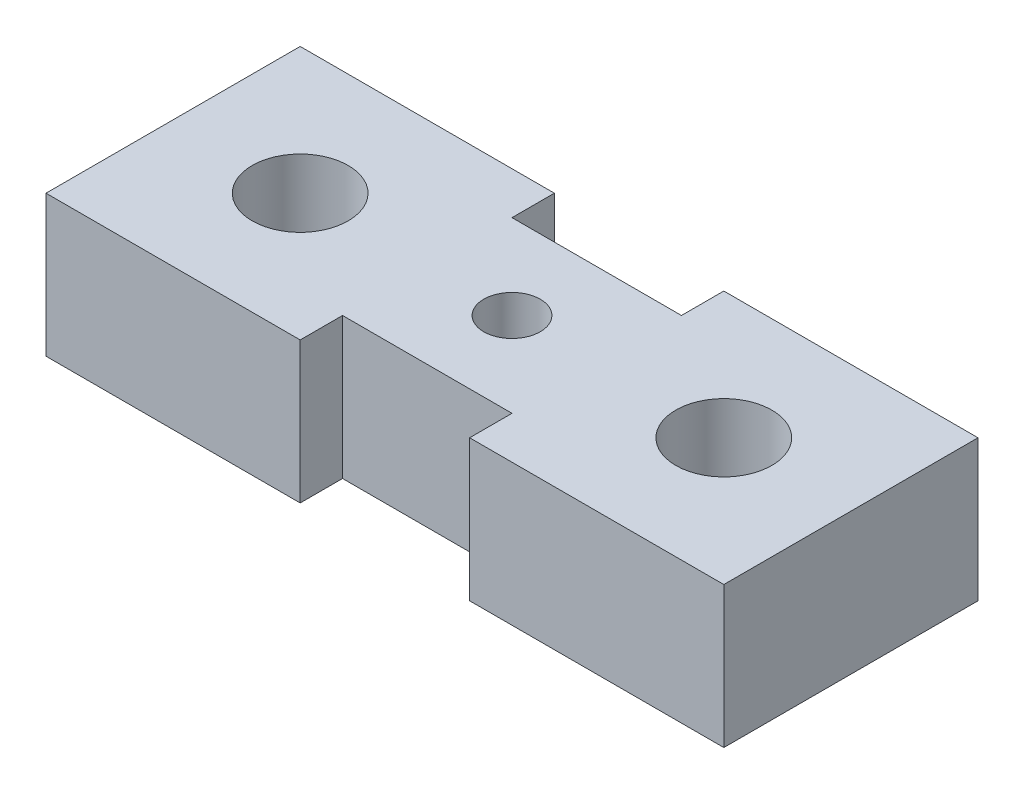
ISO-10303-21;
HEADER;
FILE_DESCRIPTION(('STEP AP214'),'2;1');
FILE_NAME('part.step','',(''),(''),'','','');
FILE_SCHEMA(('AUTOMOTIVE_DESIGN { 1 0 10303 214 1 1 1 1 }'));
ENDSEC;
DATA;
#1=APPLICATION_CONTEXT('core data for automotive mechanical design processes');
#2=APPLICATION_PROTOCOL_DEFINITION('international standard','automotive_design',2000,#1);
#3=PRODUCT_CONTEXT('',#1,'mechanical');
#4=PRODUCT('Part','Part','',(#3));
#5=PRODUCT_RELATED_PRODUCT_CATEGORY('part','',(#4));
#6=PRODUCT_DEFINITION_FORMATION('','',#4);
#7=PRODUCT_DEFINITION_CONTEXT('part definition',#1,'design');
#8=PRODUCT_DEFINITION('design','',#6,#7);
#9=PRODUCT_DEFINITION_SHAPE('','',#8);
#10=(LENGTH_UNIT() NAMED_UNIT(*) SI_UNIT(.MILLI.,.METRE.));
#11=(NAMED_UNIT(*) PLANE_ANGLE_UNIT() SI_UNIT($,.RADIAN.));
#12=(NAMED_UNIT(*) SI_UNIT($,.STERADIAN.) SOLID_ANGLE_UNIT());
#13=UNCERTAINTY_MEASURE_WITH_UNIT(LENGTH_MEASURE(1.E-05),#10,'distance_accuracy_value','');
#14=(GEOMETRIC_REPRESENTATION_CONTEXT(3) GLOBAL_UNCERTAINTY_ASSIGNED_CONTEXT((#13)) GLOBAL_UNIT_ASSIGNED_CONTEXT((#10,
#11,#12)) REPRESENTATION_CONTEXT('',''));
#15=CARTESIAN_POINT('',(0.,0.,0.));
#16=DIRECTION('',(0.,0.,1.));
#17=DIRECTION('',(1.,0.,0.));
#18=AXIS2_PLACEMENT_3D('',#15,#16,#17);
#19=CARTESIAN_POINT('',(-114.694405771183,5.,29.4556087548719));
#20=DIRECTION('',(0.,0.,-1.));
#21=DIRECTION('',(-1.,0.,0.));
#22=AXIS2_PLACEMENT_3D('',#19,#20,#21);
#23=PLANE('',#22);
#24=DIRECTION('',(1.,0.,0.));
#25=VECTOR('',#24,1.);
#26=CARTESIAN_POINT('',(-114.694405771183,5.,29.4556087548719));
#27=LINE('',#26,#25);
#28=CARTESIAN_POINT('',(-99.6944057711826,5.,29.4556087548719));
#29=VERTEX_POINT('',#28);
#30=CARTESIAN_POINT('',(-90.6944057711826,5.,29.4556087548719));
#31=VERTEX_POINT('',#30);
#32=EDGE_CURVE('E233',#29,#31,#27,.T.);
#33=ORIENTED_EDGE('',*,*,#32,.F.);
#34=DIRECTION('',(0.,1.,0.));
#35=VECTOR('',#34,1.);
#36=CARTESIAN_POINT('',(-99.6944057711826,0.,29.4556087548719));
#37=LINE('',#36,#35);
#38=CARTESIAN_POINT('',(-99.6944057711826,0.,29.4556087548719));
#39=VERTEX_POINT('',#38);
#40=EDGE_CURVE('E171',#39,#29,#37,.T.);
#41=ORIENTED_EDGE('',*,*,#40,.F.);
#42=DIRECTION('',(1.,0.,0.));
#43=VECTOR('',#42,1.);
#44=CARTESIAN_POINT('',(-114.694405771183,0.,29.4556087548719));
#45=LINE('',#44,#43);
#46=CARTESIAN_POINT('',(-90.6944057711826,0.,29.4556087548719));
#47=VERTEX_POINT('',#46);
#48=EDGE_CURVE('E153',#39,#47,#45,.T.);
#49=ORIENTED_EDGE('',*,*,#48,.T.);
#50=DIRECTION('',(0.,-1.,0.));
#51=VECTOR('',#50,1.);
#52=CARTESIAN_POINT('',(-90.6944057711826,5.,29.4556087548719));
#53=LINE('',#52,#51);
#54=EDGE_CURVE('E48',#31,#47,#53,.T.);
#55=ORIENTED_EDGE('',*,*,#54,.F.);
#56=EDGE_LOOP('',(#33,#41,#49,#55));
#57=FACE_BOUND('',#56,.T.);
#58=ADVANCED_FACE('F39',(#57),#23,.F.);
#59=CARTESIAN_POINT('',(-114.694405771183,5.,20.4556087548719));
#60=DIRECTION('',(0.,0.,1.));
#61=DIRECTION('',(1.,0.,0.));
#62=AXIS2_PLACEMENT_3D('',#59,#60,#61);
#63=PLANE('',#62);
#64=DIRECTION('',(-1.,0.,0.));
#65=VECTOR('',#64,1.);
#66=CARTESIAN_POINT('',(-114.694405771183,5.,20.4556087548719));
#67=LINE('',#66,#65);
#68=CARTESIAN_POINT('',(-105.694405771183,5.,20.4556087548719));
#69=VERTEX_POINT('',#68);
#70=CARTESIAN_POINT('',(-114.694405771183,5.,20.4556087548719));
#71=VERTEX_POINT('',#70);
#72=EDGE_CURVE('E242',#69,#71,#67,.T.);
#73=ORIENTED_EDGE('',*,*,#72,.F.);
#74=DIRECTION('',(0.,1.,0.));
#75=VECTOR('',#74,1.);
#76=CARTESIAN_POINT('',(-105.694405771183,0.,20.4556087548719));
#77=LINE('',#76,#75);
#78=CARTESIAN_POINT('',(-105.694405771183,0.,20.4556087548719));
#79=VERTEX_POINT('',#78);
#80=EDGE_CURVE('E168',#79,#69,#77,.T.);
#81=ORIENTED_EDGE('',*,*,#80,.F.);
#82=DIRECTION('',(-1.,0.,0.));
#83=VECTOR('',#82,1.);
#84=CARTESIAN_POINT('',(-114.694405771183,0.,20.4556087548719));
#85=LINE('',#84,#83);
#86=CARTESIAN_POINT('',(-114.694405771183,0.,20.4556087548719));
#87=VERTEX_POINT('',#86);
#88=EDGE_CURVE('E260',#79,#87,#85,.T.);
#89=ORIENTED_EDGE('',*,*,#88,.T.);
#90=DIRECTION('',(0.,-1.,0.));
#91=VECTOR('',#90,1.);
#92=CARTESIAN_POINT('',(-114.694405771183,5.,20.4556087548719));
#93=LINE('',#92,#91);
#94=EDGE_CURVE('E247',#71,#87,#93,.T.);
#95=ORIENTED_EDGE('',*,*,#94,.F.);
#96=EDGE_LOOP('',(#73,#81,#89,#95));
#97=FACE_BOUND('',#96,.T.);
#98=ADVANCED_FACE('F310',(#97),#63,.F.);
#99=CARTESIAN_POINT('',(-114.694405771183,5.,20.4556087548719));
#100=DIRECTION('',(1.,0.,0.));
#101=DIRECTION('',(0.,0.,-1.));
#102=AXIS2_PLACEMENT_3D('',#99,#100,#101);
#103=PLANE('',#102);
#104=DIRECTION('',(0.,0.,1.));
#105=VECTOR('',#104,1.);
#106=CARTESIAN_POINT('',(-114.694405771183,0.,20.4556087548719));
#107=LINE('',#106,#105);
#108=CARTESIAN_POINT('',(-114.694405771183,0.,29.4556087548719));
#109=VERTEX_POINT('',#108);
#110=EDGE_CURVE('E248',#87,#109,#107,.T.);
#111=ORIENTED_EDGE('',*,*,#110,.T.);
#112=DIRECTION('',(0.,-1.,0.));
#113=VECTOR('',#112,1.);
#114=CARTESIAN_POINT('',(-114.694405771183,5.,29.4556087548719));
#115=LINE('',#114,#113);
#116=CARTESIAN_POINT('',(-114.694405771183,5.,29.4556087548719));
#117=VERTEX_POINT('',#116);
#118=EDGE_CURVE('E11',#117,#109,#115,.T.);
#119=ORIENTED_EDGE('',*,*,#118,.F.);
#120=DIRECTION('',(0.,0.,1.));
#121=VECTOR('',#120,1.);
#122=CARTESIAN_POINT('',(-114.694405771183,5.,20.4556087548719));
#123=LINE('',#122,#121);
#124=EDGE_CURVE('E229',#71,#117,#123,.T.);
#125=ORIENTED_EDGE('',*,*,#124,.F.);
#126=ORIENTED_EDGE('',*,*,#94,.T.);
#127=EDGE_LOOP('',(#111,#119,#125,#126));
#128=FACE_BOUND('',#127,.T.);
#129=ADVANCED_FACE('F41',(#128),#103,.F.);
#130=CARTESIAN_POINT('',(-105.694405771183,0.,29.4556087548719));
#131=VERTEX_POINT('',#130);
#132=EDGE_CURVE('E253',#109,#131,#45,.T.);
#133=ORIENTED_EDGE('',*,*,#132,.T.);
#134=DIRECTION('',(0.,1.,0.));
#135=VECTOR('',#134,1.);
#136=CARTESIAN_POINT('',(-105.694405771183,0.,29.4556087548719));
#137=LINE('',#136,#135);
#138=CARTESIAN_POINT('',(-105.694405771183,5.,29.4556087548719));
#139=VERTEX_POINT('',#138);
#140=EDGE_CURVE('E175',#131,#139,#137,.T.);
#141=ORIENTED_EDGE('',*,*,#140,.T.);
#142=EDGE_CURVE('E235',#117,#139,#27,.T.);
#143=ORIENTED_EDGE('',*,*,#142,.F.);
#144=ORIENTED_EDGE('',*,*,#118,.T.);
#145=EDGE_LOOP('',(#133,#141,#143,#144));
#146=FACE_BOUND('',#145,.T.);
#147=ADVANCED_FACE('F313',(#146),#23,.F.);
#148=CARTESIAN_POINT('',(-90.6944057711826,5.,20.4556087548719));
#149=DIRECTION('',(-1.,0.,0.));
#150=DIRECTION('',(0.,0.,1.));
#151=AXIS2_PLACEMENT_3D('',#148,#149,#150);
#152=PLANE('',#151);
#153=DIRECTION('',(0.,0.,-1.));
#154=VECTOR('',#153,1.);
#155=CARTESIAN_POINT('',(-90.6944057711826,0.,20.4556087548719));
#156=LINE('',#155,#154);
#157=CARTESIAN_POINT('',(-90.6944057711826,0.,20.4556087548719));
#158=VERTEX_POINT('',#157);
#159=EDGE_CURVE('E257',#47,#158,#156,.T.);
#160=ORIENTED_EDGE('',*,*,#159,.T.);
#161=DIRECTION('',(0.,-1.,0.));
#162=VECTOR('',#161,1.);
#163=CARTESIAN_POINT('',(-90.6944057711826,5.,20.4556087548719));
#164=LINE('',#163,#162);
#165=CARTESIAN_POINT('',(-90.6944057711826,5.,20.4556087548719));
#166=VERTEX_POINT('',#165);
#167=EDGE_CURVE('E267',#166,#158,#164,.T.);
#168=ORIENTED_EDGE('',*,*,#167,.F.);
#169=DIRECTION('',(0.,0.,-1.));
#170=VECTOR('',#169,1.);
#171=CARTESIAN_POINT('',(-90.6944057711826,5.,20.4556087548719));
#172=LINE('',#171,#170);
#173=EDGE_CURVE('E239',#31,#166,#172,.T.);
#174=ORIENTED_EDGE('',*,*,#173,.F.);
#175=ORIENTED_EDGE('',*,*,#54,.T.);
#176=EDGE_LOOP('',(#160,#168,#174,#175));
#177=FACE_BOUND('',#176,.T.);
#178=ADVANCED_FACE('F275',(#177),#152,.F.);
#179=CARTESIAN_POINT('',(-99.6944057711826,0.,20.4556087548719));
#180=VERTEX_POINT('',#179);
#181=EDGE_CURVE('E234',#158,#180,#85,.T.);
#182=ORIENTED_EDGE('',*,*,#181,.T.);
#183=DIRECTION('',(0.,1.,0.));
#184=VECTOR('',#183,1.);
#185=CARTESIAN_POINT('',(-99.6944057711826,0.,20.4556087548719));
#186=LINE('',#185,#184);
#187=CARTESIAN_POINT('',(-99.6944057711826,5.,20.4556087548719));
#188=VERTEX_POINT('',#187);
#189=EDGE_CURVE('E205',#180,#188,#186,.T.);
#190=ORIENTED_EDGE('',*,*,#189,.T.);
#191=EDGE_CURVE('E243',#166,#188,#67,.T.);
#192=ORIENTED_EDGE('',*,*,#191,.F.);
#193=ORIENTED_EDGE('',*,*,#167,.T.);
#194=EDGE_LOOP('',(#182,#190,#192,#193));
#195=FACE_BOUND('',#194,.T.);
#196=ADVANCED_FACE('F281',(#195),#63,.F.);
#197=CARTESIAN_POINT('',(0.,5.,0.));
#198=DIRECTION('',(0.,1.,0.));
#199=DIRECTION('',(0.,0.,1.));
#200=AXIS2_PLACEMENT_3D('',#197,#198,#199);
#201=PLANE('',#200);
#202=CARTESIAN_POINT('',(-110.194405771183,5.,24.9556087548719));
#203=DIRECTION('',(0.,1.,0.));
#204=DIRECTION('',(0.,0.,1.));
#205=AXIS2_PLACEMENT_3D('',#202,#203,#204);
#206=CIRCLE('',#205,1.7);
#207=CARTESIAN_POINT('',(-110.194405771183,5.,26.6556087548719));
#208=VERTEX_POINT('',#207);
#209=EDGE_CURVE('E161',#208,#208,#206,.T.);
#210=ORIENTED_EDGE('',*,*,#209,.F.);
#211=EDGE_LOOP('',(#210));
#212=FACE_BOUND('',#211,.T.);
#213=DIRECTION('',(0.,0.,1.));
#214=VECTOR('',#213,1.);
#215=CARTESIAN_POINT('',(-105.694405771183,5.,20.4556087548719));
#216=LINE('',#215,#214);
#217=CARTESIAN_POINT('',(-105.694405771183,5.,21.9556087548719));
#218=VERTEX_POINT('',#217);
#219=EDGE_CURVE('E193',#69,#218,#216,.T.);
#220=ORIENTED_EDGE('',*,*,#219,.F.);
#221=ORIENTED_EDGE('',*,*,#72,.T.);
#222=ORIENTED_EDGE('',*,*,#124,.T.);
#223=ORIENTED_EDGE('',*,*,#142,.T.);
#224=DIRECTION('',(0.,0.,1.));
#225=VECTOR('',#224,1.);
#226=CARTESIAN_POINT('',(-105.694405771183,5.,29.4556087548719));
#227=LINE('',#226,#225);
#228=CARTESIAN_POINT('',(-105.694405771183,5.,27.9556087548719));
#229=VERTEX_POINT('',#228);
#230=EDGE_CURVE('E155',#229,#139,#227,.T.);
#231=ORIENTED_EDGE('',*,*,#230,.F.);
#232=DIRECTION('',(-1.,0.,0.));
#233=VECTOR('',#232,1.);
#234=CARTESIAN_POINT('',(-105.694405771183,5.,27.9556087548719));
#235=LINE('',#234,#233);
#236=CARTESIAN_POINT('',(-99.6944057711826,5.,27.9556087548719));
#237=VERTEX_POINT('',#236);
#238=EDGE_CURVE('E158',#237,#229,#235,.T.);
#239=ORIENTED_EDGE('',*,*,#238,.F.);
#240=DIRECTION('',(0.,0.,-1.));
#241=VECTOR('',#240,1.);
#242=CARTESIAN_POINT('',(-99.6944057711826,5.,29.4556087548719));
#243=LINE('',#242,#241);
#244=EDGE_CURVE('E135',#29,#237,#243,.T.);
#245=ORIENTED_EDGE('',*,*,#244,.F.);
#246=ORIENTED_EDGE('',*,*,#32,.T.);
#247=ORIENTED_EDGE('',*,*,#173,.T.);
#248=ORIENTED_EDGE('',*,*,#191,.T.);
#249=DIRECTION('',(0.,0.,-1.));
#250=VECTOR('',#249,1.);
#251=CARTESIAN_POINT('',(-99.6944057711826,5.,20.4556087548719));
#252=LINE('',#251,#250);
#253=CARTESIAN_POINT('',(-99.6944057711826,5.,21.9556087548719));
#254=VERTEX_POINT('',#253);
#255=EDGE_CURVE('E186',#254,#188,#252,.T.);
#256=ORIENTED_EDGE('',*,*,#255,.F.);
#257=DIRECTION('',(1.,0.,0.));
#258=VECTOR('',#257,1.);
#259=CARTESIAN_POINT('',(-105.694405771183,5.,21.9556087548719));
#260=LINE('',#259,#258);
#261=EDGE_CURVE('E197',#218,#254,#260,.T.);
#262=ORIENTED_EDGE('',*,*,#261,.F.);
#263=EDGE_LOOP('',(#220,#221,#222,#223,#231,#239,#245,#246,#247,#248,#256,#262));
#264=FACE_BOUND('',#263,.T.);
#265=CARTESIAN_POINT('',(-102.694405771183,5.,24.9556087548719));
#266=DIRECTION('',(0.,1.,0.));
#267=DIRECTION('',(0.,0.,1.));
#268=AXIS2_PLACEMENT_3D('',#265,#266,#267);
#269=CIRCLE('',#268,0.999999999999998);
#270=CARTESIAN_POINT('',(-102.694405771183,5.,25.9556087548719));
#271=VERTEX_POINT('',#270);
#272=EDGE_CURVE('E174',#271,#271,#269,.T.);
#273=ORIENTED_EDGE('',*,*,#272,.F.);
#274=EDGE_LOOP('',(#273));
#275=FACE_BOUND('',#274,.T.);
#276=CARTESIAN_POINT('',(-95.1944057711826,5.,24.9556087548719));
#277=DIRECTION('',(0.,1.,0.));
#278=DIRECTION('',(0.,0.,1.));
#279=AXIS2_PLACEMENT_3D('',#276,#277,#278);
#280=CIRCLE('',#279,1.7);
#281=CARTESIAN_POINT('',(-95.1944057711826,5.,26.6556087548719));
#282=VERTEX_POINT('',#281);
#283=EDGE_CURVE('E218',#282,#282,#280,.T.);
#284=ORIENTED_EDGE('',*,*,#283,.F.);
#285=EDGE_LOOP('',(#284));
#286=FACE_BOUND('',#285,.T.);
#287=ADVANCED_FACE('F286',(#212,#264,#275,#286),#201,.T.);
#288=CARTESIAN_POINT('',(0.,0.,0.));
#289=DIRECTION('',(0.,1.,0.));
#290=DIRECTION('',(0.,0.,1.));
#291=AXIS2_PLACEMENT_3D('',#288,#289,#290);
#292=PLANE('',#291);
#293=CARTESIAN_POINT('',(-110.194405771183,0.,24.9556087548719));
#294=DIRECTION('',(0.,1.,0.));
#295=DIRECTION('',(0.,0.,1.));
#296=AXIS2_PLACEMENT_3D('',#293,#294,#295);
#297=CIRCLE('',#296,1.7);
#298=CARTESIAN_POINT('',(-110.194405771183,0.,26.6556087548719));
#299=VERTEX_POINT('',#298);
#300=EDGE_CURVE('E252',#299,#299,#297,.T.);
#301=ORIENTED_EDGE('',*,*,#300,.T.);
#302=EDGE_LOOP('',(#301));
#303=FACE_BOUND('',#302,.T.);
#304=ORIENTED_EDGE('',*,*,#88,.F.);
#305=DIRECTION('',(0.,0.,1.));
#306=VECTOR('',#305,1.);
#307=CARTESIAN_POINT('',(-105.694405771183,0.,20.4556087548719));
#308=LINE('',#307,#306);
#309=CARTESIAN_POINT('',(-105.694405771183,0.,21.9556087548719));
#310=VERTEX_POINT('',#309);
#311=EDGE_CURVE('E181',#79,#310,#308,.T.);
#312=ORIENTED_EDGE('',*,*,#311,.T.);
#313=DIRECTION('',(1.,0.,0.));
#314=VECTOR('',#313,1.);
#315=CARTESIAN_POINT('',(-105.694405771183,0.,21.9556087548719));
#316=LINE('',#315,#314);
#317=CARTESIAN_POINT('',(-99.6944057711826,0.,21.9556087548719));
#318=VERTEX_POINT('',#317);
#319=EDGE_CURVE('E185',#310,#318,#316,.T.);
#320=ORIENTED_EDGE('',*,*,#319,.T.);
#321=DIRECTION('',(0.,0.,-1.));
#322=VECTOR('',#321,1.);
#323=CARTESIAN_POINT('',(-99.6944057711826,0.,20.4556087548719));
#324=LINE('',#323,#322);
#325=EDGE_CURVE('E55',#318,#180,#324,.T.);
#326=ORIENTED_EDGE('',*,*,#325,.T.);
#327=ORIENTED_EDGE('',*,*,#181,.F.);
#328=ORIENTED_EDGE('',*,*,#159,.F.);
#329=ORIENTED_EDGE('',*,*,#48,.F.);
#330=DIRECTION('',(0.,0.,-1.));
#331=VECTOR('',#330,1.);
#332=CARTESIAN_POINT('',(-99.6944057711826,0.,29.4556087548719));
#333=LINE('',#332,#331);
#334=CARTESIAN_POINT('',(-99.6944057711826,0.,27.9556087548719));
#335=VERTEX_POINT('',#334);
#336=EDGE_CURVE('E132',#39,#335,#333,.T.);
#337=ORIENTED_EDGE('',*,*,#336,.T.);
#338=DIRECTION('',(-1.,0.,0.));
#339=VECTOR('',#338,1.);
#340=CARTESIAN_POINT('',(-105.694405771183,0.,27.9556087548719));
#341=LINE('',#340,#339);
#342=CARTESIAN_POINT('',(-105.694405771183,0.,27.9556087548719));
#343=VERTEX_POINT('',#342);
#344=EDGE_CURVE('E143',#335,#343,#341,.T.);
#345=ORIENTED_EDGE('',*,*,#344,.T.);
#346=DIRECTION('',(0.,0.,1.));
#347=VECTOR('',#346,1.);
#348=CARTESIAN_POINT('',(-105.694405771183,0.,29.4556087548719));
#349=LINE('',#348,#347);
#350=EDGE_CURVE('E63',#343,#131,#349,.T.);
#351=ORIENTED_EDGE('',*,*,#350,.T.);
#352=ORIENTED_EDGE('',*,*,#132,.F.);
#353=ORIENTED_EDGE('',*,*,#110,.F.);
#354=EDGE_LOOP('',(#304,#312,#320,#326,#327,#328,#329,#337,#345,#351,#352,#353));
#355=FACE_BOUND('',#354,.T.);
#356=CARTESIAN_POINT('',(-102.694405771183,0.,24.9556087548719));
#357=DIRECTION('',(0.,1.,0.));
#358=DIRECTION('',(0.,0.,1.));
#359=AXIS2_PLACEMENT_3D('',#356,#357,#358);
#360=CIRCLE('',#359,0.999999999999998);
#361=CARTESIAN_POINT('',(-102.694405771183,0.,25.9556087548719));
#362=VERTEX_POINT('',#361);
#363=EDGE_CURVE('E222',#362,#362,#360,.T.);
#364=ORIENTED_EDGE('',*,*,#363,.T.);
#365=EDGE_LOOP('',(#364));
#366=FACE_BOUND('',#365,.T.);
#367=CARTESIAN_POINT('',(-95.1944057711826,0.,24.9556087548719));
#368=DIRECTION('',(0.,1.,0.));
#369=DIRECTION('',(0.,0.,1.));
#370=AXIS2_PLACEMENT_3D('',#367,#368,#369);
#371=CIRCLE('',#370,1.7);
#372=CARTESIAN_POINT('',(-95.1944057711826,0.,26.6556087548719));
#373=VERTEX_POINT('',#372);
#374=EDGE_CURVE('E214',#373,#373,#371,.T.);
#375=ORIENTED_EDGE('',*,*,#374,.T.);
#376=EDGE_LOOP('',(#375));
#377=FACE_BOUND('',#376,.T.);
#378=ADVANCED_FACE('F150',(#303,#355,#366,#377),#292,.F.);
#379=CARTESIAN_POINT('',(-95.1944057711826,0.,24.9556087548719));
#380=DIRECTION('',(0.,1.,0.));
#381=DIRECTION('',(0.,0.,1.));
#382=AXIS2_PLACEMENT_3D('',#379,#380,#381);
#383=CYLINDRICAL_SURFACE('',#382,1.7);
#384=ORIENTED_EDGE('',*,*,#374,.F.);
#385=EDGE_LOOP('',(#384));
#386=FACE_BOUND('',#385,.T.);
#387=ORIENTED_EDGE('',*,*,#283,.T.);
#388=EDGE_LOOP('',(#387));
#389=FACE_BOUND('',#388,.T.);
#390=ADVANCED_FACE('F306',(#386,#389),#383,.F.);
#391=CARTESIAN_POINT('',(-102.694405771183,0.,24.9556087548719));
#392=DIRECTION('',(0.,1.,0.));
#393=DIRECTION('',(0.,0.,1.));
#394=AXIS2_PLACEMENT_3D('',#391,#392,#393);
#395=CYLINDRICAL_SURFACE('',#394,0.999999999999998);
#396=ORIENTED_EDGE('',*,*,#363,.F.);
#397=EDGE_LOOP('',(#396));
#398=FACE_BOUND('',#397,.T.);
#399=ORIENTED_EDGE('',*,*,#272,.T.);
#400=EDGE_LOOP('',(#399));
#401=FACE_BOUND('',#400,.T.);
#402=ADVANCED_FACE('F350',(#398,#401),#395,.F.);
#403=CARTESIAN_POINT('',(-99.6944057711826,0.,29.4556087548719));
#404=DIRECTION('',(1.,0.,0.));
#405=DIRECTION('',(0.,0.,-1.));
#406=AXIS2_PLACEMENT_3D('',#403,#404,#405);
#407=PLANE('',#406);
#408=ORIENTED_EDGE('',*,*,#244,.T.);
#409=DIRECTION('',(0.,1.,0.));
#410=VECTOR('',#409,1.);
#411=CARTESIAN_POINT('',(-99.6944057711826,0.,27.9556087548719));
#412=LINE('',#411,#410);
#413=EDGE_CURVE('E128',#335,#237,#412,.T.);
#414=ORIENTED_EDGE('',*,*,#413,.F.);
#415=ORIENTED_EDGE('',*,*,#336,.F.);
#416=ORIENTED_EDGE('',*,*,#40,.T.);
#417=EDGE_LOOP('',(#408,#414,#415,#416));
#418=FACE_BOUND('',#417,.T.);
#419=ADVANCED_FACE('F130',(#418),#407,.F.);
#420=CARTESIAN_POINT('',(-105.694405771183,0.,29.4556087548719));
#421=DIRECTION('',(-1.,0.,0.));
#422=DIRECTION('',(0.,0.,1.));
#423=AXIS2_PLACEMENT_3D('',#420,#421,#422);
#424=PLANE('',#423);
#425=ORIENTED_EDGE('',*,*,#230,.T.);
#426=ORIENTED_EDGE('',*,*,#140,.F.);
#427=ORIENTED_EDGE('',*,*,#350,.F.);
#428=DIRECTION('',(0.,1.,0.));
#429=VECTOR('',#428,1.);
#430=CARTESIAN_POINT('',(-105.694405771183,0.,27.9556087548719));
#431=LINE('',#430,#429);
#432=EDGE_CURVE('E140',#343,#229,#431,.T.);
#433=ORIENTED_EDGE('',*,*,#432,.T.);
#434=EDGE_LOOP('',(#425,#426,#427,#433));
#435=FACE_BOUND('',#434,.T.);
#436=ADVANCED_FACE('F357',(#435),#424,.F.);
#437=CARTESIAN_POINT('',(-105.694405771183,0.,27.9556087548719));
#438=DIRECTION('',(0.,0.,-1.));
#439=DIRECTION('',(-1.,0.,0.));
#440=AXIS2_PLACEMENT_3D('',#437,#438,#439);
#441=PLANE('',#440);
#442=ORIENTED_EDGE('',*,*,#238,.T.);
#443=ORIENTED_EDGE('',*,*,#432,.F.);
#444=ORIENTED_EDGE('',*,*,#344,.F.);
#445=ORIENTED_EDGE('',*,*,#413,.T.);
#446=EDGE_LOOP('',(#442,#443,#444,#445));
#447=FACE_BOUND('',#446,.T.);
#448=ADVANCED_FACE('F144',(#447),#441,.F.);
#449=CARTESIAN_POINT('',(-105.694405771183,0.,20.4556087548719));
#450=DIRECTION('',(-1.,0.,0.));
#451=DIRECTION('',(0.,0.,1.));
#452=AXIS2_PLACEMENT_3D('',#449,#450,#451);
#453=PLANE('',#452);
#454=ORIENTED_EDGE('',*,*,#219,.T.);
#455=DIRECTION('',(0.,1.,0.));
#456=VECTOR('',#455,1.);
#457=CARTESIAN_POINT('',(-105.694405771183,0.,21.9556087548719));
#458=LINE('',#457,#456);
#459=EDGE_CURVE('E192',#310,#218,#458,.T.);
#460=ORIENTED_EDGE('',*,*,#459,.F.);
#461=ORIENTED_EDGE('',*,*,#311,.F.);
#462=ORIENTED_EDGE('',*,*,#80,.T.);
#463=EDGE_LOOP('',(#454,#460,#461,#462));
#464=FACE_BOUND('',#463,.T.);
#465=ADVANCED_FACE('F333',(#464),#453,.F.);
#466=CARTESIAN_POINT('',(-99.6944057711826,0.,20.4556087548719));
#467=DIRECTION('',(1.,0.,0.));
#468=DIRECTION('',(0.,0.,-1.));
#469=AXIS2_PLACEMENT_3D('',#466,#467,#468);
#470=PLANE('',#469);
#471=ORIENTED_EDGE('',*,*,#255,.T.);
#472=ORIENTED_EDGE('',*,*,#189,.F.);
#473=ORIENTED_EDGE('',*,*,#325,.F.);
#474=DIRECTION('',(0.,1.,0.));
#475=VECTOR('',#474,1.);
#476=CARTESIAN_POINT('',(-99.6944057711826,0.,21.9556087548719));
#477=LINE('',#476,#475);
#478=EDGE_CURVE('E209',#318,#254,#477,.T.);
#479=ORIENTED_EDGE('',*,*,#478,.T.);
#480=EDGE_LOOP('',(#471,#472,#473,#479));
#481=FACE_BOUND('',#480,.T.);
#482=ADVANCED_FACE('F337',(#481),#470,.F.);
#483=CARTESIAN_POINT('',(-105.694405771183,0.,21.9556087548719));
#484=DIRECTION('',(0.,0.,1.));
#485=DIRECTION('',(1.,0.,0.));
#486=AXIS2_PLACEMENT_3D('',#483,#484,#485);
#487=PLANE('',#486);
#488=ORIENTED_EDGE('',*,*,#261,.T.);
#489=ORIENTED_EDGE('',*,*,#478,.F.);
#490=ORIENTED_EDGE('',*,*,#319,.F.);
#491=ORIENTED_EDGE('',*,*,#459,.T.);
#492=EDGE_LOOP('',(#488,#489,#490,#491));
#493=FACE_BOUND('',#492,.T.);
#494=ADVANCED_FACE('F335',(#493),#487,.F.);
#495=CARTESIAN_POINT('',(-110.194405771183,0.,24.9556087548719));
#496=DIRECTION('',(0.,1.,0.));
#497=DIRECTION('',(0.,0.,1.));
#498=AXIS2_PLACEMENT_3D('',#495,#496,#497);
#499=CYLINDRICAL_SURFACE('',#498,1.7);
#500=ORIENTED_EDGE('',*,*,#300,.F.);
#501=EDGE_LOOP('',(#500));
#502=FACE_BOUND('',#501,.T.);
#503=ORIENTED_EDGE('',*,*,#209,.T.);
#504=EDGE_LOOP('',(#503));
#505=FACE_BOUND('',#504,.T.);
#506=ADVANCED_FACE('F298',(#502,#505),#499,.F.);
#507=CLOSED_SHELL('',(#58,#98,#129,#147,#178,#196,#287,#378,#390,#402,#419,#436,#448,#465,#482,
#494,#506));
#508=MANIFOLD_SOLID_BREP('B2',#507);
#509=ADVANCED_BREP_SHAPE_REPRESENTATION('',(#18,#508),#14);
#510=SHAPE_DEFINITION_REPRESENTATION(#9,#509);
ENDSEC;
END-ISO-10303-21;
